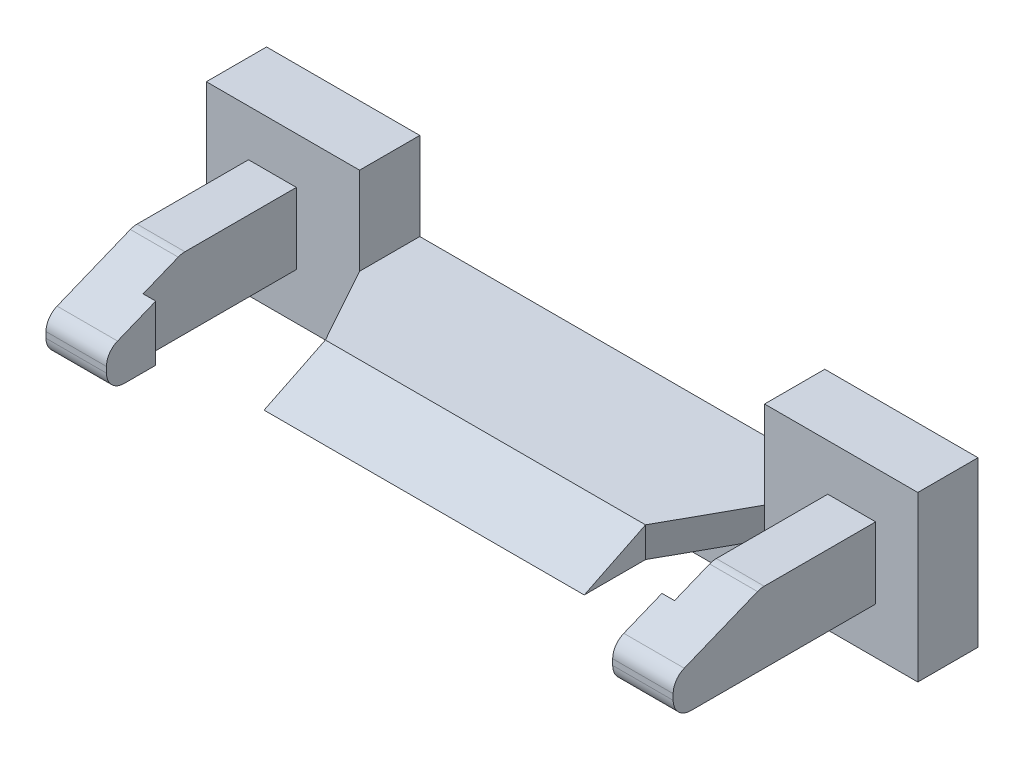
ISO-10303-21;
HEADER;
FILE_DESCRIPTION(('STEP AP214'),'2;1');
FILE_NAME('part.step','',(''),(''),'','','');
FILE_SCHEMA(('AUTOMOTIVE_DESIGN { 1 0 10303 214 1 1 1 1 }'));
ENDSEC;
DATA;
#1=APPLICATION_CONTEXT('core data for automotive mechanical design processes');
#2=APPLICATION_PROTOCOL_DEFINITION('international standard','automotive_design',2000,#1);
#3=PRODUCT_CONTEXT('',#1,'mechanical');
#4=PRODUCT('Part','Part','',(#3));
#5=PRODUCT_RELATED_PRODUCT_CATEGORY('part','',(#4));
#6=PRODUCT_DEFINITION_FORMATION('','',#4);
#7=PRODUCT_DEFINITION_CONTEXT('part definition',#1,'design');
#8=PRODUCT_DEFINITION('design','',#6,#7);
#9=PRODUCT_DEFINITION_SHAPE('','',#8);
#10=(LENGTH_UNIT() NAMED_UNIT(*) SI_UNIT(.MILLI.,.METRE.));
#11=(NAMED_UNIT(*) PLANE_ANGLE_UNIT() SI_UNIT($,.RADIAN.));
#12=(NAMED_UNIT(*) SI_UNIT($,.STERADIAN.) SOLID_ANGLE_UNIT());
#13=UNCERTAINTY_MEASURE_WITH_UNIT(LENGTH_MEASURE(1.E-05),#10,'distance_accuracy_value','');
#14=(GEOMETRIC_REPRESENTATION_CONTEXT(3) GLOBAL_UNCERTAINTY_ASSIGNED_CONTEXT((#13)) GLOBAL_UNIT_ASSIGNED_CONTEXT((#10,
#11,#12)) REPRESENTATION_CONTEXT('',''));
#15=CARTESIAN_POINT('',(0.,0.,0.));
#16=DIRECTION('',(0.,0.,1.));
#17=DIRECTION('',(1.,0.,0.));
#18=AXIS2_PLACEMENT_3D('',#15,#16,#17);
#19=CARTESIAN_POINT('',(4.625,-0.218763919545653,4.475));
#20=DIRECTION('',(1.,0.,0.));
#21=DIRECTION('',(0.,0.,-1.));
#22=AXIS2_PLACEMENT_3D('',#19,#20,#21);
#23=PLANE('',#22);
#24=CARTESIAN_POINT('',(4.625,-0.325000000000004,4.475));
#25=DIRECTION('',(-1.,0.,0.));
#26=DIRECTION('',(0.,-1.,0.));
#27=AXIS2_PLACEMENT_3D('',#24,#25,#26);
#28=CIRCLE('',#27,0.325);
#29=CARTESIAN_POINT('',(4.625,-0.325000000000004,4.8));
#30=VERTEX_POINT('',#29);
#31=CARTESIAN_POINT('',(4.625,-0.65,4.475));
#32=VERTEX_POINT('',#31);
#33=EDGE_CURVE('E231',#30,#32,#28,.F.);
#34=ORIENTED_EDGE('',*,*,#33,.F.);
#35=DIRECTION('',(0.,1.,0.));
#36=VECTOR('',#35,1.);
#37=CARTESIAN_POINT('',(4.625,-0.65,4.8));
#38=LINE('',#37,#36);
#39=CARTESIAN_POINT('',(4.625,-0.218763919545653,4.8));
#40=VERTEX_POINT('',#39);
#41=EDGE_CURVE('E227',#30,#40,#38,.T.);
#42=ORIENTED_EDGE('',*,*,#41,.T.);
#43=CARTESIAN_POINT('',(4.625,-0.218763919545653,4.475));
#44=DIRECTION('',(1.,0.,0.));
#45=DIRECTION('',(0.,0.,-1.));
#46=AXIS2_PLACEMENT_3D('',#43,#44,#45);
#47=CIRCLE('',#46,0.325);
#48=CARTESIAN_POINT('',(4.625,0.0823377180190975,4.59732254026068));
#49=VERTEX_POINT('',#48);
#50=EDGE_CURVE('E19',#49,#40,#47,.T.);
#51=ORIENTED_EDGE('',*,*,#50,.F.);
#52=DIRECTION('',(0.,-0.376377046955938,0.926466577122309));
#53=VECTOR('',#52,1.);
#54=CARTESIAN_POINT('',(4.625,0.,4.8));
#55=LINE('',#54,#53);
#56=CARTESIAN_POINT('',(4.625,0.365624999999999,3.9));
#57=VERTEX_POINT('',#56);
#58=EDGE_CURVE('E222',#57,#49,#55,.T.);
#59=ORIENTED_EDGE('',*,*,#58,.F.);
#60=DIRECTION('',(0.,1.,0.));
#61=VECTOR('',#60,1.);
#62=CARTESIAN_POINT('',(4.625,-0.65,3.9));
#63=LINE('',#62,#61);
#64=CARTESIAN_POINT('',(4.625,-0.65,3.9));
#65=VERTEX_POINT('',#64);
#66=EDGE_CURVE('E261',#65,#57,#63,.T.);
#67=ORIENTED_EDGE('',*,*,#66,.F.);
#68=DIRECTION('',(0.,0.,1.));
#69=VECTOR('',#68,1.);
#70=CARTESIAN_POINT('',(4.625,-0.65,4.8));
#71=LINE('',#70,#69);
#72=EDGE_CURVE('E275',#32,#65,#71,.F.);
#73=ORIENTED_EDGE('',*,*,#72,.F.);
#74=EDGE_LOOP('',(#34,#42,#51,#59,#67,#73));
#75=FACE_BOUND('',#74,.T.);
#76=ADVANCED_FACE('F16',(#75),#23,.F.);
#77=CARTESIAN_POINT('',(4.625,-0.65,3.9));
#78=DIRECTION('',(0.,0.,-1.));
#79=DIRECTION('',(-1.,0.,0.));
#80=AXIS2_PLACEMENT_3D('',#77,#78,#79);
#81=PLANE('',#80);
#82=ORIENTED_EDGE('',*,*,#66,.T.);
#83=DIRECTION('',(1.,0.,0.));
#84=VECTOR('',#83,1.);
#85=CARTESIAN_POINT('',(14.1788797160821,0.365624999999999,3.9));
#86=LINE('',#85,#84);
#87=CARTESIAN_POINT('',(4.855,0.365625,3.9));
#88=VERTEX_POINT('',#87);
#89=EDGE_CURVE('E259',#88,#57,#86,.F.);
#90=ORIENTED_EDGE('',*,*,#89,.F.);
#91=DIRECTION('',(0.,1.,0.));
#92=VECTOR('',#91,1.);
#93=CARTESIAN_POINT('',(4.855,-0.65,3.9));
#94=LINE('',#93,#92);
#95=CARTESIAN_POINT('',(4.855,-0.65,3.9));
#96=VERTEX_POINT('',#95);
#97=EDGE_CURVE('E264',#96,#88,#94,.T.);
#98=ORIENTED_EDGE('',*,*,#97,.F.);
#99=DIRECTION('',(1.,0.,0.));
#100=VECTOR('',#99,1.);
#101=CARTESIAN_POINT('',(5.73,-0.65,3.9));
#102=LINE('',#101,#100);
#103=EDGE_CURVE('E271',#65,#96,#102,.T.);
#104=ORIENTED_EDGE('',*,*,#103,.F.);
#105=EDGE_LOOP('',(#82,#90,#98,#104));
#106=FACE_BOUND('',#105,.T.);
#107=ADVANCED_FACE('F937',(#106),#81,.T.);
#108=CARTESIAN_POINT('',(14.1788797160821,0.,4.8));
#109=DIRECTION('',(0.,0.926466577122309,0.376377046955938));
#110=DIRECTION('',(0.,-0.376377046955938,0.926466577122309));
#111=AXIS2_PLACEMENT_3D('',#108,#109,#110);
#112=PLANE('',#111);
#113=DIRECTION('',(0.,-0.376377046955938,0.926466577122309));
#114=VECTOR('',#113,1.);
#115=CARTESIAN_POINT('',(5.73,0.626101637564755,3.25882673830214));
#116=LINE('',#115,#114);
#117=CARTESIAN_POINT('',(5.73,0.626101637564755,3.25882673830214));
#118=VERTEX_POINT('',#117);
#119=CARTESIAN_POINT('',(5.73,0.0823377180190975,4.59732254026068));
#120=VERTEX_POINT('',#119);
#121=EDGE_CURVE('E318',#118,#120,#116,.T.);
#122=ORIENTED_EDGE('',*,*,#121,.F.);
#123=DIRECTION('',(1.,0.,0.));
#124=VECTOR('',#123,1.);
#125=CARTESIAN_POINT('',(14.1788797160821,0.626101637564759,3.25882673830213));
#126=LINE('',#125,#124);
#127=CARTESIAN_POINT('',(4.855,0.626101637564754,3.25882673830214));
#128=VERTEX_POINT('',#127);
#129=EDGE_CURVE('E321',#128,#118,#126,.T.);
#130=ORIENTED_EDGE('',*,*,#129,.F.);
#131=DIRECTION('',(0.,0.376377046955936,-0.92646657712231));
#132=VECTOR('',#131,1.);
#133=CARTESIAN_POINT('',(4.855,0.365625,3.9));
#134=LINE('',#133,#132);
#135=EDGE_CURVE('E267',#88,#128,#134,.T.);
#136=ORIENTED_EDGE('',*,*,#135,.F.);
#137=ORIENTED_EDGE('',*,*,#89,.T.);
#138=ORIENTED_EDGE('',*,*,#58,.T.);
#139=DIRECTION('',(1.,0.,0.));
#140=VECTOR('',#139,1.);
#141=CARTESIAN_POINT('',(14.1788797160821,0.0823377180190974,4.59732254026068));
#142=LINE('',#141,#140);
#143=EDGE_CURVE('E241',#120,#49,#142,.F.);
#144=ORIENTED_EDGE('',*,*,#143,.F.);
#145=EDGE_LOOP('',(#122,#130,#136,#137,#138,#144));
#146=FACE_BOUND('',#145,.T.);
#147=ADVANCED_FACE('F929',(#146),#112,.T.);
#148=CARTESIAN_POINT('',(14.1788797160821,-0.218763919545653,4.475));
#149=DIRECTION('',(1.,0.,0.));
#150=DIRECTION('',(0.,0.,-1.));
#151=AXIS2_PLACEMENT_3D('',#148,#149,#150);
#152=CYLINDRICAL_SURFACE('',#151,0.325);
#153=DIRECTION('',(-1.,0.,0.));
#154=VECTOR('',#153,1.);
#155=CARTESIAN_POINT('',(5.73,-0.218763919545653,4.8));
#156=LINE('',#155,#154);
#157=CARTESIAN_POINT('',(5.73,-0.218763919545653,4.8));
#158=VERTEX_POINT('',#157);
#159=EDGE_CURVE('E235',#40,#158,#156,.F.);
#160=ORIENTED_EDGE('',*,*,#159,.T.);
#161=CARTESIAN_POINT('',(5.73,-0.218763919545653,4.475));
#162=DIRECTION('',(1.,0.,0.));
#163=DIRECTION('',(0.,0.,-1.));
#164=AXIS2_PLACEMENT_3D('',#161,#162,#163);
#165=CIRCLE('',#164,0.325);
#166=EDGE_CURVE('E316',#120,#158,#165,.T.);
#167=ORIENTED_EDGE('',*,*,#166,.F.);
#168=ORIENTED_EDGE('',*,*,#143,.T.);
#169=ORIENTED_EDGE('',*,*,#50,.T.);
#170=EDGE_LOOP('',(#160,#167,#168,#169));
#171=FACE_BOUND('',#170,.T.);
#172=ADVANCED_FACE('F238',(#171),#152,.T.);
#173=CARTESIAN_POINT('',(5.73,-0.65,4.8));
#174=DIRECTION('',(0.,0.,-1.));
#175=DIRECTION('',(-1.,0.,0.));
#176=AXIS2_PLACEMENT_3D('',#173,#174,#175);
#177=PLANE('',#176);
#178=ORIENTED_EDGE('',*,*,#159,.F.);
#179=ORIENTED_EDGE('',*,*,#41,.F.);
#180=DIRECTION('',(-1.,0.,0.));
#181=VECTOR('',#180,1.);
#182=CARTESIAN_POINT('',(5.73,-0.325000000000004,4.8));
#183=LINE('',#182,#181);
#184=CARTESIAN_POINT('',(5.73,-0.325000000000004,4.8));
#185=VERTEX_POINT('',#184);
#186=EDGE_CURVE('E246',#185,#30,#183,.T.);
#187=ORIENTED_EDGE('',*,*,#186,.F.);
#188=DIRECTION('',(0.,1.,0.));
#189=VECTOR('',#188,1.);
#190=CARTESIAN_POINT('',(5.73,0.65,4.8));
#191=LINE('',#190,#189);
#192=EDGE_CURVE('E244',#158,#185,#191,.F.);
#193=ORIENTED_EDGE('',*,*,#192,.F.);
#194=EDGE_LOOP('',(#178,#179,#187,#193));
#195=FACE_BOUND('',#194,.T.);
#196=ADVANCED_FACE('F242',(#195),#177,.F.);
#197=CARTESIAN_POINT('',(5.73,-0.325000000000004,4.475));
#198=DIRECTION('',(-1.,0.,0.));
#199=DIRECTION('',(0.,-1.,0.));
#200=AXIS2_PLACEMENT_3D('',#197,#198,#199);
#201=CYLINDRICAL_SURFACE('',#200,0.325);
#202=ORIENTED_EDGE('',*,*,#33,.T.);
#203=DIRECTION('',(1.,0.,0.));
#204=VECTOR('',#203,1.);
#205=CARTESIAN_POINT('',(5.73,-0.65,4.475));
#206=LINE('',#205,#204);
#207=CARTESIAN_POINT('',(5.73,-0.65,4.475));
#208=VERTEX_POINT('',#207);
#209=EDGE_CURVE('E283',#208,#32,#206,.F.);
#210=ORIENTED_EDGE('',*,*,#209,.F.);
#211=CARTESIAN_POINT('',(5.73,-0.325000000000004,4.475));
#212=DIRECTION('',(-1.,0.,0.));
#213=DIRECTION('',(0.,-1.,0.));
#214=AXIS2_PLACEMENT_3D('',#211,#212,#213);
#215=CIRCLE('',#214,0.325);
#216=EDGE_CURVE('E312',#185,#208,#215,.F.);
#217=ORIENTED_EDGE('',*,*,#216,.F.);
#218=ORIENTED_EDGE('',*,*,#186,.T.);
#219=EDGE_LOOP('',(#202,#210,#217,#218));
#220=FACE_BOUND('',#219,.T.);
#221=ADVANCED_FACE('F907',(#220),#201,.T.);
#222=CARTESIAN_POINT('',(5.73,-0.65,4.8));
#223=DIRECTION('',(0.,-1.,0.));
#224=DIRECTION('',(1.,0.,0.));
#225=AXIS2_PLACEMENT_3D('',#222,#223,#224);
#226=PLANE('',#225);
#227=DIRECTION('',(0.,0.,1.));
#228=VECTOR('',#227,1.);
#229=CARTESIAN_POINT('',(4.855,-0.65,4.8));
#230=LINE('',#229,#228);
#231=CARTESIAN_POINT('',(4.855,-0.65,1.1));
#232=VERTEX_POINT('',#231);
#233=EDGE_CURVE('E252',#232,#96,#230,.T.);
#234=ORIENTED_EDGE('',*,*,#233,.F.);
#235=DIRECTION('',(1.,0.,0.));
#236=VECTOR('',#235,1.);
#237=CARTESIAN_POINT('',(5.73,-0.65,1.1));
#238=LINE('',#237,#236);
#239=CARTESIAN_POINT('',(5.73,-0.65,1.1));
#240=VERTEX_POINT('',#239);
#241=EDGE_CURVE('E274',#232,#240,#238,.T.);
#242=ORIENTED_EDGE('',*,*,#241,.T.);
#243=DIRECTION('',(0.,0.,-1.));
#244=VECTOR('',#243,1.);
#245=CARTESIAN_POINT('',(5.73,-0.65,4.8));
#246=LINE('',#245,#244);
#247=EDGE_CURVE('E315',#208,#240,#246,.T.);
#248=ORIENTED_EDGE('',*,*,#247,.F.);
#249=ORIENTED_EDGE('',*,*,#209,.T.);
#250=ORIENTED_EDGE('',*,*,#72,.T.);
#251=ORIENTED_EDGE('',*,*,#103,.T.);
#252=EDGE_LOOP('',(#234,#242,#248,#249,#250,#251));
#253=FACE_BOUND('',#252,.T.);
#254=ADVANCED_FACE('F335',(#253),#226,.T.);
#255=CARTESIAN_POINT('',(-4.855,-0.65,4.8));
#256=DIRECTION('',(-1.,0.,0.));
#257=DIRECTION('',(0.,0.,1.));
#258=AXIS2_PLACEMENT_3D('',#255,#256,#257);
#259=PLANE('',#258);
#260=DIRECTION('',(0.,1.,0.));
#261=VECTOR('',#260,1.);
#262=CARTESIAN_POINT('',(-4.855,0.365625,3.9));
#263=LINE('',#262,#261);
#264=CARTESIAN_POINT('',(-4.855,-0.65,3.9));
#265=VERTEX_POINT('',#264);
#266=CARTESIAN_POINT('',(-4.855,0.365624999999999,3.9));
#267=VERTEX_POINT('',#266);
#268=EDGE_CURVE('E395',#265,#267,#263,.T.);
#269=ORIENTED_EDGE('',*,*,#268,.F.);
#270=DIRECTION('',(0.,0.,1.));
#271=VECTOR('',#270,1.);
#272=CARTESIAN_POINT('',(-4.855,-0.65,4.8));
#273=LINE('',#272,#271);
#274=CARTESIAN_POINT('',(-4.855,-0.65,1.1));
#275=VERTEX_POINT('',#274);
#276=EDGE_CURVE('E429',#265,#275,#273,.F.);
#277=ORIENTED_EDGE('',*,*,#276,.T.);
#278=DIRECTION('',(0.,1.,0.));
#279=VECTOR('',#278,1.);
#280=CARTESIAN_POINT('',(-4.855,-0.65,1.1));
#281=LINE('',#280,#279);
#282=CARTESIAN_POINT('',(-4.855,0.65,1.1));
#283=VERTEX_POINT('',#282);
#284=EDGE_CURVE('E323',#283,#275,#281,.F.);
#285=ORIENTED_EDGE('',*,*,#284,.F.);
#286=DIRECTION('',(0.,0.,1.));
#287=VECTOR('',#286,1.);
#288=CARTESIAN_POINT('',(-4.855,0.65,4.8));
#289=LINE('',#288,#287);
#290=CARTESIAN_POINT('',(-4.855,0.65,3.13650419804148));
#291=VERTEX_POINT('',#290);
#292=EDGE_CURVE('E407',#283,#291,#289,.T.);
#293=ORIENTED_EDGE('',*,*,#292,.T.);
#294=CARTESIAN_POINT('',(-4.855,0.325,3.13650419804148));
#295=DIRECTION('',(-1.,0.,0.));
#296=DIRECTION('',(0.,0.,1.));
#297=AXIS2_PLACEMENT_3D('',#294,#295,#296);
#298=CIRCLE('',#297,0.325);
#299=CARTESIAN_POINT('',(-4.855,0.626101637564748,3.25882673830216));
#300=VERTEX_POINT('',#299);
#301=EDGE_CURVE('E322',#300,#291,#298,.T.);
#302=ORIENTED_EDGE('',*,*,#301,.F.);
#303=DIRECTION('',(0.,0.376377046955939,-0.926466577122309));
#304=VECTOR('',#303,1.);
#305=CARTESIAN_POINT('',(-4.855,0.365625,3.9));
#306=LINE('',#305,#304);
#307=EDGE_CURVE('E404',#267,#300,#306,.T.);
#308=ORIENTED_EDGE('',*,*,#307,.F.);
#309=EDGE_LOOP('',(#269,#277,#285,#293,#302,#308));
#310=FACE_BOUND('',#309,.T.);
#311=ADVANCED_FACE('F493',(#310),#259,.F.);
#312=CARTESIAN_POINT('',(-4.625,0.365625,3.9));
#313=DIRECTION('',(0.,0.,-1.));
#314=DIRECTION('',(-1.,0.,0.));
#315=AXIS2_PLACEMENT_3D('',#312,#313,#314);
#316=PLANE('',#315);
#317=DIRECTION('',(0.,1.,0.));
#318=VECTOR('',#317,1.);
#319=CARTESIAN_POINT('',(-4.625,-0.325,3.9));
#320=LINE('',#319,#318);
#321=CARTESIAN_POINT('',(-4.625,0.365624999999999,3.9));
#322=VERTEX_POINT('',#321);
#323=CARTESIAN_POINT('',(-4.625,-0.65,3.9));
#324=VERTEX_POINT('',#323);
#325=EDGE_CURVE('E268',#322,#324,#320,.F.);
#326=ORIENTED_EDGE('',*,*,#325,.T.);
#327=DIRECTION('',(-1.,0.,0.));
#328=VECTOR('',#327,1.);
#329=CARTESIAN_POINT('',(-5.73,-0.65,3.9));
#330=LINE('',#329,#328);
#331=EDGE_CURVE('E423',#324,#265,#330,.T.);
#332=ORIENTED_EDGE('',*,*,#331,.T.);
#333=ORIENTED_EDGE('',*,*,#268,.T.);
#334=DIRECTION('',(1.,0.,0.));
#335=VECTOR('',#334,1.);
#336=CARTESIAN_POINT('',(-14.1788797160821,0.365624999999999,3.9));
#337=LINE('',#336,#335);
#338=EDGE_CURVE('E391',#267,#322,#337,.T.);
#339=ORIENTED_EDGE('',*,*,#338,.T.);
#340=EDGE_LOOP('',(#326,#332,#333,#339));
#341=FACE_BOUND('',#340,.T.);
#342=ADVANCED_FACE('F497',(#341),#316,.T.);
#343=CARTESIAN_POINT('',(-4.625,-0.325,4.475));
#344=DIRECTION('',(-1.,0.,0.));
#345=DIRECTION('',(0.,0.,1.));
#346=AXIS2_PLACEMENT_3D('',#343,#344,#345);
#347=PLANE('',#346);
#348=DIRECTION('',(0.,0.376377046955938,-0.926466577122309));
#349=VECTOR('',#348,1.);
#350=CARTESIAN_POINT('',(-4.625,0.,4.8));
#351=LINE('',#350,#349);
#352=CARTESIAN_POINT('',(-4.625,0.0823377180190975,4.59732254026068));
#353=VERTEX_POINT('',#352);
#354=EDGE_CURVE('E304',#322,#353,#351,.F.);
#355=ORIENTED_EDGE('',*,*,#354,.T.);
#356=CARTESIAN_POINT('',(-4.625,-0.218763919545653,4.475));
#357=DIRECTION('',(1.,0.,0.));
#358=DIRECTION('',(0.,0.,-1.));
#359=AXIS2_PLACEMENT_3D('',#356,#357,#358);
#360=CIRCLE('',#359,0.325);
#361=CARTESIAN_POINT('',(-4.625,-0.218763919545653,4.8));
#362=VERTEX_POINT('',#361);
#363=EDGE_CURVE('E300',#362,#353,#360,.F.);
#364=ORIENTED_EDGE('',*,*,#363,.F.);
#365=DIRECTION('',(0.,1.,0.));
#366=VECTOR('',#365,1.);
#367=CARTESIAN_POINT('',(-4.625,-0.65,4.8));
#368=LINE('',#367,#366);
#369=CARTESIAN_POINT('',(-4.625,-0.325000000000004,4.8));
#370=VERTEX_POINT('',#369);
#371=EDGE_CURVE('E385',#370,#362,#368,.T.);
#372=ORIENTED_EDGE('',*,*,#371,.F.);
#373=CARTESIAN_POINT('',(-4.625,-0.325000000000004,4.475));
#374=DIRECTION('',(1.,0.,0.));
#375=DIRECTION('',(0.,1.,0.));
#376=AXIS2_PLACEMENT_3D('',#373,#374,#375);
#377=CIRCLE('',#376,0.325);
#378=CARTESIAN_POINT('',(-4.625,-0.65,4.475));
#379=VERTEX_POINT('',#378);
#380=EDGE_CURVE('E305',#379,#370,#377,.F.);
#381=ORIENTED_EDGE('',*,*,#380,.F.);
#382=DIRECTION('',(0.,0.,1.));
#383=VECTOR('',#382,1.);
#384=CARTESIAN_POINT('',(-4.625,-0.65,4.8));
#385=LINE('',#384,#383);
#386=EDGE_CURVE('E420',#379,#324,#385,.F.);
#387=ORIENTED_EDGE('',*,*,#386,.T.);
#388=ORIENTED_EDGE('',*,*,#325,.F.);
#389=EDGE_LOOP('',(#355,#364,#372,#381,#387,#388));
#390=FACE_BOUND('',#389,.T.);
#391=ADVANCED_FACE('F503',(#390),#347,.F.);
#392=CARTESIAN_POINT('',(4.855,-0.65,4.8));
#393=DIRECTION('',(-1.,0.,0.));
#394=DIRECTION('',(0.,0.,1.));
#395=AXIS2_PLACEMENT_3D('',#392,#393,#394);
#396=PLANE('',#395);
#397=DIRECTION('',(0.,1.,0.));
#398=VECTOR('',#397,1.);
#399=CARTESIAN_POINT('',(4.855,-0.65,1.1));
#400=LINE('',#399,#398);
#401=CARTESIAN_POINT('',(4.855,0.65,1.1));
#402=VERTEX_POINT('',#401);
#403=EDGE_CURVE('E256',#402,#232,#400,.F.);
#404=ORIENTED_EDGE('',*,*,#403,.T.);
#405=ORIENTED_EDGE('',*,*,#233,.T.);
#406=ORIENTED_EDGE('',*,*,#97,.T.);
#407=ORIENTED_EDGE('',*,*,#135,.T.);
#408=CARTESIAN_POINT('',(4.855,0.325000000000004,3.13650419804147));
#409=DIRECTION('',(1.,0.,0.));
#410=DIRECTION('',(0.,0.,-1.));
#411=AXIS2_PLACEMENT_3D('',#408,#409,#410);
#412=CIRCLE('',#411,0.325);
#413=CARTESIAN_POINT('',(4.855,0.65,3.13650419804146));
#414=VERTEX_POINT('',#413);
#415=EDGE_CURVE('E255',#414,#128,#412,.T.);
#416=ORIENTED_EDGE('',*,*,#415,.F.);
#417=DIRECTION('',(0.,0.,1.));
#418=VECTOR('',#417,1.);
#419=CARTESIAN_POINT('',(4.855,0.65,4.8));
#420=LINE('',#419,#418);
#421=EDGE_CURVE('E363',#402,#414,#420,.T.);
#422=ORIENTED_EDGE('',*,*,#421,.F.);
#423=EDGE_LOOP('',(#404,#405,#406,#407,#416,#422));
#424=FACE_BOUND('',#423,.T.);
#425=ADVANCED_FACE('F869',(#424),#396,.T.);
#426=CARTESIAN_POINT('',(14.1788797160821,0.325000000000006,3.13650419804146));
#427=DIRECTION('',(1.,0.,0.));
#428=DIRECTION('',(0.,0.,-1.));
#429=AXIS2_PLACEMENT_3D('',#426,#427,#428);
#430=CYLINDRICAL_SURFACE('',#429,0.325);
#431=ORIENTED_EDGE('',*,*,#415,.T.);
#432=ORIENTED_EDGE('',*,*,#129,.T.);
#433=CARTESIAN_POINT('',(5.73,0.325000000000004,3.13650419804147));
#434=DIRECTION('',(1.,0.,0.));
#435=DIRECTION('',(0.,0.,-1.));
#436=AXIS2_PLACEMENT_3D('',#433,#434,#435);
#437=CIRCLE('',#436,0.325);
#438=CARTESIAN_POINT('',(5.73,0.65,3.13650419804146));
#439=VERTEX_POINT('',#438);
#440=EDGE_CURVE('E308',#439,#118,#437,.T.);
#441=ORIENTED_EDGE('',*,*,#440,.F.);
#442=DIRECTION('',(-1.,0.,0.));
#443=VECTOR('',#442,1.);
#444=CARTESIAN_POINT('',(4.855,0.65,3.13650419804146));
#445=LINE('',#444,#443);
#446=EDGE_CURVE('E360',#414,#439,#445,.F.);
#447=ORIENTED_EDGE('',*,*,#446,.F.);
#448=EDGE_LOOP('',(#431,#432,#441,#447));
#449=FACE_BOUND('',#448,.T.);
#450=ADVANCED_FACE('F861',(#449),#430,.T.);
#451=CARTESIAN_POINT('',(5.73,0.65,4.8));
#452=DIRECTION('',(1.,0.,0.));
#453=DIRECTION('',(0.,0.,-1.));
#454=AXIS2_PLACEMENT_3D('',#451,#452,#453);
#455=PLANE('',#454);
#456=DIRECTION('',(0.,0.,1.));
#457=VECTOR('',#456,1.);
#458=CARTESIAN_POINT('',(5.73,0.65,4.8));
#459=LINE('',#458,#457);
#460=CARTESIAN_POINT('',(5.73,0.65,1.1));
#461=VERTEX_POINT('',#460);
#462=EDGE_CURVE('E299',#439,#461,#459,.F.);
#463=ORIENTED_EDGE('',*,*,#462,.F.);
#464=ORIENTED_EDGE('',*,*,#440,.T.);
#465=ORIENTED_EDGE('',*,*,#121,.T.);
#466=ORIENTED_EDGE('',*,*,#166,.T.);
#467=ORIENTED_EDGE('',*,*,#192,.T.);
#468=ORIENTED_EDGE('',*,*,#216,.T.);
#469=ORIENTED_EDGE('',*,*,#247,.T.);
#470=DIRECTION('',(0.,1.,0.));
#471=VECTOR('',#470,1.);
#472=CARTESIAN_POINT('',(5.73,0.65,1.1));
#473=LINE('',#472,#471);
#474=EDGE_CURVE('E311',#240,#461,#473,.T.);
#475=ORIENTED_EDGE('',*,*,#474,.T.);
#476=EDGE_LOOP('',(#463,#464,#465,#466,#467,#468,#469,#475));
#477=FACE_BOUND('',#476,.T.);
#478=ADVANCED_FACE('F348',(#477),#455,.T.);
#479=CARTESIAN_POINT('',(-5.73,-0.325000000000004,4.475));
#480=DIRECTION('',(1.,0.,0.));
#481=DIRECTION('',(0.,1.,0.));
#482=AXIS2_PLACEMENT_3D('',#479,#480,#481);
#483=CYLINDRICAL_SURFACE('',#482,0.325);
#484=ORIENTED_EDGE('',*,*,#380,.T.);
#485=DIRECTION('',(1.,0.,0.));
#486=VECTOR('',#485,1.);
#487=CARTESIAN_POINT('',(-5.73,-0.325000000000004,4.8));
#488=LINE('',#487,#486);
#489=CARTESIAN_POINT('',(-5.73,-0.325000000000004,4.8));
#490=VERTEX_POINT('',#489);
#491=EDGE_CURVE('E389',#490,#370,#488,.T.);
#492=ORIENTED_EDGE('',*,*,#491,.F.);
#493=CARTESIAN_POINT('',(-5.73,-0.325000000000004,4.475));
#494=DIRECTION('',(1.,0.,0.));
#495=DIRECTION('',(0.,1.,0.));
#496=AXIS2_PLACEMENT_3D('',#493,#494,#495);
#497=CIRCLE('',#496,0.325);
#498=CARTESIAN_POINT('',(-5.73,-0.65,4.475));
#499=VERTEX_POINT('',#498);
#500=EDGE_CURVE('E296',#490,#499,#497,.T.);
#501=ORIENTED_EDGE('',*,*,#500,.T.);
#502=DIRECTION('',(-1.,0.,0.));
#503=VECTOR('',#502,1.);
#504=CARTESIAN_POINT('',(-5.73,-0.65,4.475));
#505=LINE('',#504,#503);
#506=EDGE_CURVE('E424',#499,#379,#505,.F.);
#507=ORIENTED_EDGE('',*,*,#506,.T.);
#508=EDGE_LOOP('',(#484,#492,#501,#507));
#509=FACE_BOUND('',#508,.T.);
#510=ADVANCED_FACE('F507',(#509),#483,.T.);
#511=CARTESIAN_POINT('',(-5.73,-0.65,4.8));
#512=DIRECTION('',(0.,1.,0.));
#513=DIRECTION('',(-1.,0.,0.));
#514=AXIS2_PLACEMENT_3D('',#511,#512,#513);
#515=PLANE('',#514);
#516=ORIENTED_EDGE('',*,*,#331,.F.);
#517=ORIENTED_EDGE('',*,*,#386,.F.);
#518=ORIENTED_EDGE('',*,*,#506,.F.);
#519=DIRECTION('',(0.,0.,-1.));
#520=VECTOR('',#519,1.);
#521=CARTESIAN_POINT('',(-5.73,-0.65,4.8));
#522=LINE('',#521,#520);
#523=CARTESIAN_POINT('',(-5.73,-0.65,1.1));
#524=VERTEX_POINT('',#523);
#525=EDGE_CURVE('E298',#499,#524,#522,.T.);
#526=ORIENTED_EDGE('',*,*,#525,.T.);
#527=DIRECTION('',(-1.,0.,0.));
#528=VECTOR('',#527,1.);
#529=CARTESIAN_POINT('',(-5.73,-0.65,1.1));
#530=LINE('',#529,#528);
#531=EDGE_CURVE('E307',#275,#524,#530,.T.);
#532=ORIENTED_EDGE('',*,*,#531,.F.);
#533=ORIENTED_EDGE('',*,*,#276,.F.);
#534=EDGE_LOOP('',(#516,#517,#518,#526,#532,#533));
#535=FACE_BOUND('',#534,.T.);
#536=ADVANCED_FACE('F457',(#535),#515,.F.);
#537=CARTESIAN_POINT('',(-4.855,0.65,4.8));
#538=DIRECTION('',(0.,-1.,0.));
#539=DIRECTION('',(1.,0.,0.));
#540=AXIS2_PLACEMENT_3D('',#537,#538,#539);
#541=PLANE('',#540);
#542=DIRECTION('',(-1.,0.,0.));
#543=VECTOR('',#542,1.);
#544=CARTESIAN_POINT('',(-4.855,0.65,3.13650419804148));
#545=LINE('',#544,#543);
#546=CARTESIAN_POINT('',(-5.73,0.65,3.13650419804148));
#547=VERTEX_POINT('',#546);
#548=EDGE_CURVE('E410',#291,#547,#545,.T.);
#549=ORIENTED_EDGE('',*,*,#548,.F.);
#550=ORIENTED_EDGE('',*,*,#292,.F.);
#551=DIRECTION('',(1.,0.,0.));
#552=VECTOR('',#551,1.);
#553=CARTESIAN_POINT('',(-4.855,0.65,1.1));
#554=LINE('',#553,#552);
#555=CARTESIAN_POINT('',(-5.73,0.65,1.1));
#556=VERTEX_POINT('',#555);
#557=EDGE_CURVE('E411',#556,#283,#554,.T.);
#558=ORIENTED_EDGE('',*,*,#557,.F.);
#559=DIRECTION('',(0.,0.,-1.));
#560=VECTOR('',#559,1.);
#561=CARTESIAN_POINT('',(-5.73,0.65,4.8));
#562=LINE('',#561,#560);
#563=EDGE_CURVE('E295',#556,#547,#562,.F.);
#564=ORIENTED_EDGE('',*,*,#563,.T.);
#565=EDGE_LOOP('',(#549,#550,#558,#564));
#566=FACE_BOUND('',#565,.T.);
#567=ADVANCED_FACE('F492',(#566),#541,.F.);
#568=CARTESIAN_POINT('',(-4.855,0.325,3.13650419804148));
#569=DIRECTION('',(-1.,0.,0.));
#570=DIRECTION('',(0.,0.,1.));
#571=AXIS2_PLACEMENT_3D('',#568,#569,#570);
#572=CYLINDRICAL_SURFACE('',#571,0.325);
#573=ORIENTED_EDGE('',*,*,#301,.T.);
#574=ORIENTED_EDGE('',*,*,#548,.T.);
#575=CARTESIAN_POINT('',(-5.73,0.325,3.13650419804148));
#576=DIRECTION('',(-1.,0.,0.));
#577=DIRECTION('',(0.,0.,1.));
#578=AXIS2_PLACEMENT_3D('',#575,#576,#577);
#579=CIRCLE('',#578,0.325);
#580=CARTESIAN_POINT('',(-5.73,0.626101637564747,3.25882673830216));
#581=VERTEX_POINT('',#580);
#582=EDGE_CURVE('E293',#547,#581,#579,.F.);
#583=ORIENTED_EDGE('',*,*,#582,.T.);
#584=DIRECTION('',(1.,0.,0.));
#585=VECTOR('',#584,1.);
#586=CARTESIAN_POINT('',(-14.1788797160821,0.626101637564746,3.25882673830216));
#587=LINE('',#586,#585);
#588=EDGE_CURVE('E399',#581,#300,#587,.T.);
#589=ORIENTED_EDGE('',*,*,#588,.T.);
#590=EDGE_LOOP('',(#573,#574,#583,#589));
#591=FACE_BOUND('',#590,.T.);
#592=ADVANCED_FACE('F490',(#591),#572,.T.);
#593=CARTESIAN_POINT('',(-14.1788797160821,0.,4.8));
#594=DIRECTION('',(0.,-0.926466577122309,-0.376377046955938));
#595=DIRECTION('',(0.,0.376377046955938,-0.926466577122309));
#596=AXIS2_PLACEMENT_3D('',#593,#594,#595);
#597=PLANE('',#596);
#598=DIRECTION('',(1.,0.,0.));
#599=VECTOR('',#598,1.);
#600=CARTESIAN_POINT('',(-14.1788797160821,0.0823377180190974,4.59732254026068));
#601=LINE('',#600,#599);
#602=CARTESIAN_POINT('',(-5.73,0.0823377180190974,4.59732254026068));
#603=VERTEX_POINT('',#602);
#604=EDGE_CURVE('E303',#353,#603,#601,.F.);
#605=ORIENTED_EDGE('',*,*,#604,.F.);
#606=ORIENTED_EDGE('',*,*,#354,.F.);
#607=ORIENTED_EDGE('',*,*,#338,.F.);
#608=ORIENTED_EDGE('',*,*,#307,.T.);
#609=ORIENTED_EDGE('',*,*,#588,.F.);
#610=DIRECTION('',(0.,-0.376377046955939,0.926466577122309));
#611=VECTOR('',#610,1.);
#612=CARTESIAN_POINT('',(-5.73,0.626101637564748,3.25882673830216));
#613=LINE('',#612,#611);
#614=EDGE_CURVE('E292',#581,#603,#613,.T.);
#615=ORIENTED_EDGE('',*,*,#614,.T.);
#616=EDGE_LOOP('',(#605,#606,#607,#608,#609,#615));
#617=FACE_BOUND('',#616,.T.);
#618=ADVANCED_FACE('F501',(#617),#597,.F.);
#619=CARTESIAN_POINT('',(-14.1788797160821,-0.218763919545653,4.475));
#620=DIRECTION('',(1.,0.,0.));
#621=DIRECTION('',(0.,0.,-1.));
#622=AXIS2_PLACEMENT_3D('',#619,#620,#621);
#623=CYLINDRICAL_SURFACE('',#622,0.325);
#624=ORIENTED_EDGE('',*,*,#363,.T.);
#625=ORIENTED_EDGE('',*,*,#604,.T.);
#626=CARTESIAN_POINT('',(-5.73,-0.218763919545653,4.475));
#627=DIRECTION('',(1.,0.,0.));
#628=DIRECTION('',(0.,0.,-1.));
#629=AXIS2_PLACEMENT_3D('',#626,#627,#628);
#630=CIRCLE('',#629,0.325);
#631=CARTESIAN_POINT('',(-5.73,-0.218763919545653,4.8));
#632=VERTEX_POINT('',#631);
#633=EDGE_CURVE('E289',#603,#632,#630,.T.);
#634=ORIENTED_EDGE('',*,*,#633,.T.);
#635=DIRECTION('',(1.,0.,0.));
#636=VECTOR('',#635,1.);
#637=CARTESIAN_POINT('',(-5.73,-0.218763919545653,4.8));
#638=LINE('',#637,#636);
#639=EDGE_CURVE('E388',#362,#632,#638,.F.);
#640=ORIENTED_EDGE('',*,*,#639,.F.);
#641=EDGE_LOOP('',(#624,#625,#634,#640));
#642=FACE_BOUND('',#641,.T.);
#643=ADVANCED_FACE('F810',(#642),#623,.T.);
#644=CARTESIAN_POINT('',(-5.73,-0.65,4.8));
#645=DIRECTION('',(0.,0.,1.));
#646=DIRECTION('',(1.,0.,0.));
#647=AXIS2_PLACEMENT_3D('',#644,#645,#646);
#648=PLANE('',#647);
#649=ORIENTED_EDGE('',*,*,#639,.T.);
#650=DIRECTION('',(0.,1.,0.));
#651=VECTOR('',#650,1.);
#652=CARTESIAN_POINT('',(-5.73,0.65,4.8));
#653=LINE('',#652,#651);
#654=EDGE_CURVE('E291',#632,#490,#653,.F.);
#655=ORIENTED_EDGE('',*,*,#654,.T.);
#656=ORIENTED_EDGE('',*,*,#491,.T.);
#657=ORIENTED_EDGE('',*,*,#371,.T.);
#658=EDGE_LOOP('',(#649,#655,#656,#657));
#659=FACE_BOUND('',#658,.T.);
#660=ADVANCED_FACE('F802',(#659),#648,.T.);
#661=CARTESIAN_POINT('',(2.925,-13.8240700230838,3.62));
#662=DIRECTION('',(1.,0.,0.));
#663=DIRECTION('',(0.,0.,-1.));
#664=AXIS2_PLACEMENT_3D('',#661,#662,#663);
#665=PLANE('',#664);
#666=DIRECTION('',(0.,1.,0.));
#667=VECTOR('',#666,1.);
#668=CARTESIAN_POINT('',(2.925,-13.8240700230838,2.5));
#669=LINE('',#668,#667);
#670=CARTESIAN_POINT('',(2.925,-0.0999999999999999,2.5));
#671=VERTEX_POINT('',#670);
#672=CARTESIAN_POINT('',(2.925,-0.649999999999998,2.5));
#673=VERTEX_POINT('',#672);
#674=EDGE_CURVE('E511',#671,#673,#669,.F.);
#675=ORIENTED_EDGE('',*,*,#674,.F.);
#676=DIRECTION('',(0.,-0.440790605784194,0.897609960869644));
#677=VECTOR('',#676,1.);
#678=CARTESIAN_POINT('',(2.925,-0.65,3.62));
#679=LINE('',#678,#677);
#680=CARTESIAN_POINT('',(2.925,-0.649999999999999,3.62));
#681=VERTEX_POINT('',#680);
#682=EDGE_CURVE('E524',#681,#671,#679,.F.);
#683=ORIENTED_EDGE('',*,*,#682,.F.);
#684=DIRECTION('',(0.,0.,1.));
#685=VECTOR('',#684,1.);
#686=CARTESIAN_POINT('',(2.925,-0.649999999999998,3.62));
#687=LINE('',#686,#685);
#688=EDGE_CURVE('E479',#681,#673,#687,.F.);
#689=ORIENTED_EDGE('',*,*,#688,.T.);
#690=EDGE_LOOP('',(#675,#683,#689));
#691=FACE_BOUND('',#690,.T.);
#692=ADVANCED_FACE('F652',(#691),#665,.T.);
#693=CARTESIAN_POINT('',(-2.925,-13.8240700230838,3.62));
#694=DIRECTION('',(1.,0.,0.));
#695=DIRECTION('',(0.,0.,-1.));
#696=AXIS2_PLACEMENT_3D('',#693,#694,#695);
#697=PLANE('',#696);
#698=DIRECTION('',(0.,1.,0.));
#699=VECTOR('',#698,1.);
#700=CARTESIAN_POINT('',(-2.925,-13.8240700230838,2.5));
#701=LINE('',#700,#699);
#702=CARTESIAN_POINT('',(-2.925,-0.1,2.5));
#703=VERTEX_POINT('',#702);
#704=CARTESIAN_POINT('',(-2.925,-0.649999999999998,2.5));
#705=VERTEX_POINT('',#704);
#706=EDGE_CURVE('E527',#703,#705,#701,.F.);
#707=ORIENTED_EDGE('',*,*,#706,.T.);
#708=DIRECTION('',(0.,0.,1.));
#709=VECTOR('',#708,1.);
#710=CARTESIAN_POINT('',(-2.925,-0.65,3.62));
#711=LINE('',#710,#709);
#712=CARTESIAN_POINT('',(-2.925,-0.65,3.62));
#713=VERTEX_POINT('',#712);
#714=EDGE_CURVE('E376',#705,#713,#711,.T.);
#715=ORIENTED_EDGE('',*,*,#714,.T.);
#716=DIRECTION('',(0.,-0.440790605784194,0.897609960869644));
#717=VECTOR('',#716,1.);
#718=CARTESIAN_POINT('',(-2.925,-0.65,3.62));
#719=LINE('',#718,#717);
#720=EDGE_CURVE('E518',#703,#713,#719,.T.);
#721=ORIENTED_EDGE('',*,*,#720,.F.);
#722=EDGE_LOOP('',(#707,#715,#721));
#723=FACE_BOUND('',#722,.T.);
#724=ADVANCED_FACE('F643',(#723),#697,.F.);
#725=CARTESIAN_POINT('',(-3.7,-0.65,3.62));
#726=DIRECTION('',(0.,1.,0.));
#727=DIRECTION('',(-1.,0.,0.));
#728=AXIS2_PLACEMENT_3D('',#725,#726,#727);
#729=PLANE('',#728);
#730=ORIENTED_EDGE('',*,*,#714,.F.);
#731=DIRECTION('',(-0.484315883016802,0.,-0.87489320803036));
#732=VECTOR('',#731,1.);
#733=CARTESIAN_POINT('',(-2.925,-0.649999999999993,2.5));
#734=LINE('',#733,#732);
#735=CARTESIAN_POINT('',(-3.7,-0.649999999999995,1.1));
#736=VERTEX_POINT('',#735);
#737=EDGE_CURVE('E529',#705,#736,#734,.T.);
#738=ORIENTED_EDGE('',*,*,#737,.T.);
#739=DIRECTION('',(-1.,0.,0.));
#740=VECTOR('',#739,1.);
#741=CARTESIAN_POINT('',(6.5,-0.65,1.1));
#742=LINE('',#741,#740);
#743=CARTESIAN_POINT('',(3.7,-0.649999999999996,1.1));
#744=VERTEX_POINT('',#743);
#745=EDGE_CURVE('E534',#736,#744,#742,.F.);
#746=ORIENTED_EDGE('',*,*,#745,.T.);
#747=DIRECTION('',(0.484315883016802,0.,-0.87489320803036));
#748=VECTOR('',#747,1.);
#749=CARTESIAN_POINT('',(2.925,-0.649999999999993,2.5));
#750=LINE('',#749,#748);
#751=EDGE_CURVE('E513',#673,#744,#750,.T.);
#752=ORIENTED_EDGE('',*,*,#751,.F.);
#753=ORIENTED_EDGE('',*,*,#688,.F.);
#754=DIRECTION('',(1.,0.,0.));
#755=VECTOR('',#754,1.);
#756=CARTESIAN_POINT('',(13.8240765697478,-0.65,3.62));
#757=LINE('',#756,#755);
#758=EDGE_CURVE('E521',#713,#681,#757,.T.);
#759=ORIENTED_EDGE('',*,*,#758,.F.);
#760=EDGE_LOOP('',(#730,#738,#746,#752,#753,#759));
#761=FACE_BOUND('',#760,.T.);
#762=ADVANCED_FACE('F646',(#761),#729,.F.);
#763=CARTESIAN_POINT('',(4.855,0.65,4.8));
#764=DIRECTION('',(0.,1.,0.));
#765=DIRECTION('',(-1.,0.,0.));
#766=AXIS2_PLACEMENT_3D('',#763,#764,#765);
#767=PLANE('',#766);
#768=ORIENTED_EDGE('',*,*,#462,.T.);
#769=DIRECTION('',(-1.,0.,0.));
#770=VECTOR('',#769,1.);
#771=CARTESIAN_POINT('',(6.5,0.65,1.1));
#772=LINE('',#771,#770);
#773=EDGE_CURVE('E343',#461,#402,#772,.T.);
#774=ORIENTED_EDGE('',*,*,#773,.T.);
#775=ORIENTED_EDGE('',*,*,#421,.T.);
#776=ORIENTED_EDGE('',*,*,#446,.T.);
#777=EDGE_LOOP('',(#768,#774,#775,#776));
#778=FACE_BOUND('',#777,.T.);
#779=ADVANCED_FACE('F662',(#778),#767,.T.);
#780=CARTESIAN_POINT('',(-5.73,0.65,4.8));
#781=DIRECTION('',(1.,0.,0.));
#782=DIRECTION('',(0.,0.,-1.));
#783=AXIS2_PLACEMENT_3D('',#780,#781,#782);
#784=PLANE('',#783);
#785=ORIENTED_EDGE('',*,*,#633,.F.);
#786=ORIENTED_EDGE('',*,*,#614,.F.);
#787=ORIENTED_EDGE('',*,*,#582,.F.);
#788=ORIENTED_EDGE('',*,*,#563,.F.);
#789=DIRECTION('',(0.,1.,0.));
#790=VECTOR('',#789,1.);
#791=CARTESIAN_POINT('',(-5.73,-1.5,1.1));
#792=LINE('',#791,#790);
#793=EDGE_CURVE('E370',#556,#524,#792,.F.);
#794=ORIENTED_EDGE('',*,*,#793,.T.);
#795=ORIENTED_EDGE('',*,*,#525,.F.);
#796=ORIENTED_EDGE('',*,*,#500,.F.);
#797=ORIENTED_EDGE('',*,*,#654,.F.);
#798=EDGE_LOOP('',(#785,#786,#787,#788,#794,#795,#796,#797));
#799=FACE_BOUND('',#798,.T.);
#800=ADVANCED_FACE('F464',(#799),#784,.F.);
#801=CARTESIAN_POINT('',(2.925,-13.8240700230838,2.5));
#802=DIRECTION('',(0.87489320803036,0.,0.484315883016802));
#803=DIRECTION('',(0.484315883016802,0.,-0.87489320803036));
#804=AXIS2_PLACEMENT_3D('',#801,#802,#803);
#805=PLANE('',#804);
#806=ORIENTED_EDGE('',*,*,#751,.T.);
#807=DIRECTION('',(0.,1.,0.));
#808=VECTOR('',#807,1.);
#809=CARTESIAN_POINT('',(3.7,-1.5,1.1));
#810=LINE('',#809,#808);
#811=CARTESIAN_POINT('',(3.7,-0.0999999999999945,1.1));
#812=VERTEX_POINT('',#811);
#813=EDGE_CURVE('E371',#744,#812,#810,.T.);
#814=ORIENTED_EDGE('',*,*,#813,.T.);
#815=DIRECTION('',(-0.484315883016806,0.,0.874893208030359));
#816=VECTOR('',#815,1.);
#817=CARTESIAN_POINT('',(3.7,-0.1,1.1));
#818=LINE('',#817,#816);
#819=EDGE_CURVE('E557',#812,#671,#818,.T.);
#820=ORIENTED_EDGE('',*,*,#819,.T.);
#821=ORIENTED_EDGE('',*,*,#674,.T.);
#822=EDGE_LOOP('',(#806,#814,#820,#821));
#823=FACE_BOUND('',#822,.T.);
#824=ADVANCED_FACE('F653',(#823),#805,.T.);
#825=CARTESIAN_POINT('',(13.8240765697478,-0.65,3.62));
#826=DIRECTION('',(0.,0.897609960869644,0.440790605784194));
#827=DIRECTION('',(0.,-0.440790605784194,0.897609960869644));
#828=AXIS2_PLACEMENT_3D('',#825,#826,#827);
#829=PLANE('',#828);
#830=ORIENTED_EDGE('',*,*,#682,.T.);
#831=DIRECTION('',(1.,0.,0.));
#832=VECTOR('',#831,1.);
#833=CARTESIAN_POINT('',(3.7,-0.1,2.5));
#834=LINE('',#833,#832);
#835=EDGE_CURVE('E560',#671,#703,#834,.F.);
#836=ORIENTED_EDGE('',*,*,#835,.T.);
#837=ORIENTED_EDGE('',*,*,#720,.T.);
#838=ORIENTED_EDGE('',*,*,#758,.T.);
#839=EDGE_LOOP('',(#830,#836,#837,#838));
#840=FACE_BOUND('',#839,.T.);
#841=ADVANCED_FACE('F650',(#840),#829,.T.);
#842=CARTESIAN_POINT('',(-2.925,-13.8240700230838,2.5));
#843=DIRECTION('',(0.87489320803036,0.,-0.484315883016802));
#844=DIRECTION('',(-0.484315883016802,0.,-0.87489320803036));
#845=AXIS2_PLACEMENT_3D('',#842,#843,#844);
#846=PLANE('',#845);
#847=ORIENTED_EDGE('',*,*,#737,.F.);
#848=ORIENTED_EDGE('',*,*,#706,.F.);
#849=DIRECTION('',(-0.484315883016805,0.,-0.874893208030359));
#850=VECTOR('',#849,1.);
#851=CARTESIAN_POINT('',(-2.925,-0.0999999999999996,2.5));
#852=LINE('',#851,#850);
#853=CARTESIAN_POINT('',(-3.7,-0.0999999999999972,1.1));
#854=VERTEX_POINT('',#853);
#855=EDGE_CURVE('E563',#703,#854,#852,.T.);
#856=ORIENTED_EDGE('',*,*,#855,.T.);
#857=DIRECTION('',(0.,1.,0.));
#858=VECTOR('',#857,1.);
#859=CARTESIAN_POINT('',(-3.7,-1.5,1.1));
#860=LINE('',#859,#858);
#861=EDGE_CURVE('E531',#854,#736,#860,.F.);
#862=ORIENTED_EDGE('',*,*,#861,.T.);
#863=EDGE_LOOP('',(#847,#848,#856,#862));
#864=FACE_BOUND('',#863,.T.);
#865=ADVANCED_FACE('F640',(#864),#846,.F.);
#866=CARTESIAN_POINT('',(6.5,-1.5,1.1));
#867=DIRECTION('',(0.,0.,-1.));
#868=DIRECTION('',(-1.,0.,0.));
#869=AXIS2_PLACEMENT_3D('',#866,#867,#868);
#870=PLANE('',#869);
#871=ORIENTED_EDGE('',*,*,#557,.T.);
#872=ORIENTED_EDGE('',*,*,#284,.T.);
#873=ORIENTED_EDGE('',*,*,#531,.T.);
#874=ORIENTED_EDGE('',*,*,#793,.F.);
#875=EDGE_LOOP('',(#871,#872,#873,#874));
#876=FACE_BOUND('',#875,.T.);
#877=ORIENTED_EDGE('',*,*,#474,.F.);
#878=ORIENTED_EDGE('',*,*,#241,.F.);
#879=ORIENTED_EDGE('',*,*,#403,.F.);
#880=ORIENTED_EDGE('',*,*,#773,.F.);
#881=EDGE_LOOP('',(#877,#878,#879,#880));
#882=FACE_BOUND('',#881,.T.);
#883=DIRECTION('',(1.,0.,0.));
#884=VECTOR('',#883,1.);
#885=CARTESIAN_POINT('',(6.5,-1.5,1.1));
#886=LINE('',#885,#884);
#887=CARTESIAN_POINT('',(6.5,-1.5,1.1));
#888=VERTEX_POINT('',#887);
#889=CARTESIAN_POINT('',(-6.5,-1.5,1.1));
#890=VERTEX_POINT('',#889);
#891=EDGE_CURVE('E541',#888,#890,#886,.F.);
#892=ORIENTED_EDGE('',*,*,#891,.F.);
#893=DIRECTION('',(0.,1.,0.));
#894=VECTOR('',#893,1.);
#895=CARTESIAN_POINT('',(6.5,1.5,1.1));
#896=LINE('',#895,#894);
#897=CARTESIAN_POINT('',(6.5,1.5,1.1));
#898=VERTEX_POINT('',#897);
#899=EDGE_CURVE('E448',#898,#888,#896,.F.);
#900=ORIENTED_EDGE('',*,*,#899,.F.);
#901=DIRECTION('',(1.,0.,0.));
#902=VECTOR('',#901,1.);
#903=CARTESIAN_POINT('',(3.7,1.5,1.1));
#904=LINE('',#903,#902);
#905=CARTESIAN_POINT('',(3.7,1.5,1.1));
#906=VERTEX_POINT('',#905);
#907=EDGE_CURVE('E574',#906,#898,#904,.T.);
#908=ORIENTED_EDGE('',*,*,#907,.F.);
#909=DIRECTION('',(0.,1.,0.));
#910=VECTOR('',#909,1.);
#911=CARTESIAN_POINT('',(3.7,-1.5,1.1));
#912=LINE('',#911,#910);
#913=EDGE_CURVE('E571',#812,#906,#912,.T.);
#914=ORIENTED_EDGE('',*,*,#913,.F.);
#915=ORIENTED_EDGE('',*,*,#813,.F.);
#916=ORIENTED_EDGE('',*,*,#745,.F.);
#917=ORIENTED_EDGE('',*,*,#861,.F.);
#918=DIRECTION('',(0.,1.,0.));
#919=VECTOR('',#918,1.);
#920=CARTESIAN_POINT('',(-3.7,-1.5,1.1));
#921=LINE('',#920,#919);
#922=CARTESIAN_POINT('',(-3.7,1.5,1.1));
#923=VERTEX_POINT('',#922);
#924=EDGE_CURVE('E554',#854,#923,#921,.T.);
#925=ORIENTED_EDGE('',*,*,#924,.T.);
#926=DIRECTION('',(1.,0.,0.));
#927=VECTOR('',#926,1.);
#928=CARTESIAN_POINT('',(-3.7,1.5,1.1));
#929=LINE('',#928,#927);
#930=CARTESIAN_POINT('',(-6.5,1.5,1.1));
#931=VERTEX_POINT('',#930);
#932=EDGE_CURVE('E548',#923,#931,#929,.F.);
#933=ORIENTED_EDGE('',*,*,#932,.T.);
#934=DIRECTION('',(0.,1.,0.));
#935=VECTOR('',#934,1.);
#936=CARTESIAN_POINT('',(-6.5,1.5,1.1));
#937=LINE('',#936,#935);
#938=EDGE_CURVE('E544',#931,#890,#937,.F.);
#939=ORIENTED_EDGE('',*,*,#938,.T.);
#940=EDGE_LOOP('',(#892,#900,#908,#914,#915,#916,#917,#925,#933,#939));
#941=FACE_BOUND('',#940,.T.);
#942=ADVANCED_FACE('F340',(#876,#882,#941),#870,.F.);
#943=CARTESIAN_POINT('',(6.5,1.5,1.1));
#944=DIRECTION('',(1.,0.,0.));
#945=DIRECTION('',(0.,0.,-1.));
#946=AXIS2_PLACEMENT_3D('',#943,#944,#945);
#947=PLANE('',#946);
#948=ORIENTED_EDGE('',*,*,#899,.T.);
#949=DIRECTION('',(0.,0.,-1.));
#950=VECTOR('',#949,1.);
#951=CARTESIAN_POINT('',(6.5,-1.5,1.1));
#952=LINE('',#951,#950);
#953=CARTESIAN_POINT('',(6.5,-1.5,0.));
#954=VERTEX_POINT('',#953);
#955=EDGE_CURVE('E538',#954,#888,#952,.F.);
#956=ORIENTED_EDGE('',*,*,#955,.F.);
#957=DIRECTION('',(0.,1.,0.));
#958=VECTOR('',#957,1.);
#959=CARTESIAN_POINT('',(6.5,-1.5,0.));
#960=LINE('',#959,#958);
#961=CARTESIAN_POINT('',(6.5,1.5,0.));
#962=VERTEX_POINT('',#961);
#963=EDGE_CURVE('E580',#962,#954,#960,.F.);
#964=ORIENTED_EDGE('',*,*,#963,.F.);
#965=DIRECTION('',(0.,0.,1.));
#966=VECTOR('',#965,1.);
#967=CARTESIAN_POINT('',(6.5,1.5,1.1));
#968=LINE('',#967,#966);
#969=EDGE_CURVE('E577',#898,#962,#968,.F.);
#970=ORIENTED_EDGE('',*,*,#969,.F.);
#971=EDGE_LOOP('',(#948,#956,#964,#970));
#972=FACE_BOUND('',#971,.T.);
#973=ADVANCED_FACE('F619',(#972),#947,.T.);
#974=CARTESIAN_POINT('',(6.5,-1.5,1.1));
#975=DIRECTION('',(0.,-1.,0.));
#976=DIRECTION('',(0.,0.,-1.));
#977=AXIS2_PLACEMENT_3D('',#974,#975,#976);
#978=PLANE('',#977);
#979=ORIENTED_EDGE('',*,*,#891,.T.);
#980=DIRECTION('',(0.,0.,-1.));
#981=VECTOR('',#980,1.);
#982=CARTESIAN_POINT('',(-6.5,-1.5,1.1));
#983=LINE('',#982,#981);
#984=CARTESIAN_POINT('',(-6.5,-1.5,0.));
#985=VERTEX_POINT('',#984);
#986=EDGE_CURVE('E546',#890,#985,#983,.T.);
#987=ORIENTED_EDGE('',*,*,#986,.T.);
#988=DIRECTION('',(-1.,0.,0.));
#989=VECTOR('',#988,1.);
#990=CARTESIAN_POINT('',(6.5,-1.5,0.));
#991=LINE('',#990,#989);
#992=EDGE_CURVE('E583',#954,#985,#991,.T.);
#993=ORIENTED_EDGE('',*,*,#992,.F.);
#994=ORIENTED_EDGE('',*,*,#955,.T.);
#995=EDGE_LOOP('',(#979,#987,#993,#994));
#996=FACE_BOUND('',#995,.T.);
#997=ADVANCED_FACE('F623',(#996),#978,.T.);
#998=CARTESIAN_POINT('',(-6.5,1.5,1.1));
#999=DIRECTION('',(1.,0.,0.));
#1000=DIRECTION('',(0.,0.,-1.));
#1001=AXIS2_PLACEMENT_3D('',#998,#999,#1000);
#1002=PLANE('',#1001);
#1003=ORIENTED_EDGE('',*,*,#986,.F.);
#1004=ORIENTED_EDGE('',*,*,#938,.F.);
#1005=DIRECTION('',(0.,0.,1.));
#1006=VECTOR('',#1005,1.);
#1007=CARTESIAN_POINT('',(-6.5,1.5,1.1));
#1008=LINE('',#1007,#1006);
#1009=CARTESIAN_POINT('',(-6.5,1.5,0.));
#1010=VERTEX_POINT('',#1009);
#1011=EDGE_CURVE('E550',#931,#1010,#1008,.F.);
#1012=ORIENTED_EDGE('',*,*,#1011,.T.);
#1013=DIRECTION('',(0.,1.,0.));
#1014=VECTOR('',#1013,1.);
#1015=CARTESIAN_POINT('',(-6.5,-1.5,0.));
#1016=LINE('',#1015,#1014);
#1017=EDGE_CURVE('E586',#985,#1010,#1016,.T.);
#1018=ORIENTED_EDGE('',*,*,#1017,.F.);
#1019=EDGE_LOOP('',(#1003,#1004,#1012,#1018));
#1020=FACE_BOUND('',#1019,.T.);
#1021=ADVANCED_FACE('F627',(#1020),#1002,.F.);
#1022=CARTESIAN_POINT('',(-3.7,1.5,1.1));
#1023=DIRECTION('',(0.,-1.,0.));
#1024=DIRECTION('',(1.,0.,0.));
#1025=AXIS2_PLACEMENT_3D('',#1022,#1023,#1024);
#1026=PLANE('',#1025);
#1027=ORIENTED_EDGE('',*,*,#1011,.F.);
#1028=ORIENTED_EDGE('',*,*,#932,.F.);
#1029=DIRECTION('',(0.,0.,1.));
#1030=VECTOR('',#1029,1.);
#1031=CARTESIAN_POINT('',(-3.7,1.5,1.1));
#1032=LINE('',#1031,#1030);
#1033=CARTESIAN_POINT('',(-3.7,1.5,0.));
#1034=VERTEX_POINT('',#1033);
#1035=EDGE_CURVE('E552',#923,#1034,#1032,.F.);
#1036=ORIENTED_EDGE('',*,*,#1035,.T.);
#1037=DIRECTION('',(-1.,0.,0.));
#1038=VECTOR('',#1037,1.);
#1039=CARTESIAN_POINT('',(6.5,1.5,0.));
#1040=LINE('',#1039,#1038);
#1041=EDGE_CURVE('E589',#1010,#1034,#1040,.F.);
#1042=ORIENTED_EDGE('',*,*,#1041,.F.);
#1043=EDGE_LOOP('',(#1027,#1028,#1036,#1042));
#1044=FACE_BOUND('',#1043,.T.);
#1045=ADVANCED_FACE('F631',(#1044),#1026,.F.);
#1046=CARTESIAN_POINT('',(-3.7,-1.5,1.1));
#1047=DIRECTION('',(-1.,0.,0.));
#1048=DIRECTION('',(0.,0.,1.));
#1049=AXIS2_PLACEMENT_3D('',#1046,#1047,#1048);
#1050=PLANE('',#1049);
#1051=DIRECTION('',(0.,0.,1.));
#1052=VECTOR('',#1051,1.);
#1053=CARTESIAN_POINT('',(-3.7,-0.0999999999999996,1.1));
#1054=LINE('',#1053,#1052);
#1055=CARTESIAN_POINT('',(-3.7,-0.0999999999999999,0.));
#1056=VERTEX_POINT('',#1055);
#1057=EDGE_CURVE('E566',#854,#1056,#1054,.F.);
#1058=ORIENTED_EDGE('',*,*,#1057,.T.);
#1059=DIRECTION('',(0.,1.,0.));
#1060=VECTOR('',#1059,1.);
#1061=CARTESIAN_POINT('',(-3.7,-1.5,0.));
#1062=LINE('',#1061,#1060);
#1063=EDGE_CURVE('E592',#1034,#1056,#1062,.F.);
#1064=ORIENTED_EDGE('',*,*,#1063,.F.);
#1065=ORIENTED_EDGE('',*,*,#1035,.F.);
#1066=ORIENTED_EDGE('',*,*,#924,.F.);
#1067=EDGE_LOOP('',(#1058,#1064,#1065,#1066));
#1068=FACE_BOUND('',#1067,.T.);
#1069=ADVANCED_FACE('F635',(#1068),#1050,.F.);
#1070=CARTESIAN_POINT('',(3.7,-0.1,1.1));
#1071=DIRECTION('',(0.,-1.,0.));
#1072=DIRECTION('',(1.,0.,0.));
#1073=AXIS2_PLACEMENT_3D('',#1070,#1071,#1072);
#1074=PLANE('',#1073);
#1075=ORIENTED_EDGE('',*,*,#855,.F.);
#1076=ORIENTED_EDGE('',*,*,#835,.F.);
#1077=ORIENTED_EDGE('',*,*,#819,.F.);
#1078=DIRECTION('',(0.,0.,1.));
#1079=VECTOR('',#1078,1.);
#1080=CARTESIAN_POINT('',(3.7,-0.1,1.1));
#1081=LINE('',#1080,#1079);
#1082=CARTESIAN_POINT('',(3.7,-0.1,0.));
#1083=VERTEX_POINT('',#1082);
#1084=EDGE_CURVE('E568',#1083,#812,#1081,.T.);
#1085=ORIENTED_EDGE('',*,*,#1084,.F.);
#1086=DIRECTION('',(-1.,0.,0.));
#1087=VECTOR('',#1086,1.);
#1088=CARTESIAN_POINT('',(6.5,-0.1,0.));
#1089=LINE('',#1088,#1087);
#1090=EDGE_CURVE('E595',#1056,#1083,#1089,.F.);
#1091=ORIENTED_EDGE('',*,*,#1090,.F.);
#1092=ORIENTED_EDGE('',*,*,#1057,.F.);
#1093=EDGE_LOOP('',(#1075,#1076,#1077,#1085,#1091,#1092));
#1094=FACE_BOUND('',#1093,.T.);
#1095=ADVANCED_FACE('F608',(#1094),#1074,.F.);
#1096=CARTESIAN_POINT('',(3.7,-1.5,1.1));
#1097=DIRECTION('',(-1.,0.,0.));
#1098=DIRECTION('',(0.,0.,1.));
#1099=AXIS2_PLACEMENT_3D('',#1096,#1097,#1098);
#1100=PLANE('',#1099);
#1101=DIRECTION('',(0.,0.,1.));
#1102=VECTOR('',#1101,1.);
#1103=CARTESIAN_POINT('',(3.7,1.5,1.1));
#1104=LINE('',#1103,#1102);
#1105=CARTESIAN_POINT('',(3.7,1.5,0.));
#1106=VERTEX_POINT('',#1105);
#1107=EDGE_CURVE('E34',#1106,#906,#1104,.T.);
#1108=ORIENTED_EDGE('',*,*,#1107,.F.);
#1109=DIRECTION('',(0.,1.,0.));
#1110=VECTOR('',#1109,1.);
#1111=CARTESIAN_POINT('',(3.7,-1.5,0.));
#1112=LINE('',#1111,#1110);
#1113=EDGE_CURVE('E25',#1083,#1106,#1112,.T.);
#1114=ORIENTED_EDGE('',*,*,#1113,.F.);
#1115=ORIENTED_EDGE('',*,*,#1084,.T.);
#1116=ORIENTED_EDGE('',*,*,#913,.T.);
#1117=EDGE_LOOP('',(#1108,#1114,#1115,#1116));
#1118=FACE_BOUND('',#1117,.T.);
#1119=ADVANCED_FACE('F602',(#1118),#1100,.T.);
#1120=CARTESIAN_POINT('',(3.7,1.5,1.1));
#1121=DIRECTION('',(0.,1.,0.));
#1122=DIRECTION('',(0.,0.,1.));
#1123=AXIS2_PLACEMENT_3D('',#1120,#1121,#1122);
#1124=PLANE('',#1123);
#1125=ORIENTED_EDGE('',*,*,#907,.T.);
#1126=ORIENTED_EDGE('',*,*,#969,.T.);
#1127=DIRECTION('',(-1.,0.,0.));
#1128=VECTOR('',#1127,1.);
#1129=CARTESIAN_POINT('',(6.5,1.5,0.));
#1130=LINE('',#1129,#1128);
#1131=EDGE_CURVE('E11',#1106,#962,#1130,.F.);
#1132=ORIENTED_EDGE('',*,*,#1131,.F.);
#1133=ORIENTED_EDGE('',*,*,#1107,.T.);
#1134=EDGE_LOOP('',(#1125,#1126,#1132,#1133));
#1135=FACE_BOUND('',#1134,.T.);
#1136=ADVANCED_FACE('F617',(#1135),#1124,.T.);
#1137=CARTESIAN_POINT('',(6.5,-1.5,0.));
#1138=DIRECTION('',(0.,0.,-1.));
#1139=DIRECTION('',(-1.,0.,0.));
#1140=AXIS2_PLACEMENT_3D('',#1137,#1138,#1139);
#1141=PLANE('',#1140);
#1142=ORIENTED_EDGE('',*,*,#1113,.T.);
#1143=ORIENTED_EDGE('',*,*,#1131,.T.);
#1144=ORIENTED_EDGE('',*,*,#963,.T.);
#1145=ORIENTED_EDGE('',*,*,#992,.T.);
#1146=ORIENTED_EDGE('',*,*,#1017,.T.);
#1147=ORIENTED_EDGE('',*,*,#1041,.T.);
#1148=ORIENTED_EDGE('',*,*,#1063,.T.);
#1149=ORIENTED_EDGE('',*,*,#1090,.T.);
#1150=EDGE_LOOP('',(#1142,#1143,#1144,#1145,#1146,#1147,#1148,#1149));
#1151=FACE_BOUND('',#1150,.T.);
#1152=ADVANCED_FACE('F600',(#1151),#1141,.T.);
#1153=CLOSED_SHELL('',(#76,#107,#147,#172,#196,#221,#254,#311,#342,#391,#425,#450,#478,#510,
#536,#567,#592,#618,#643,#660,#692,#724,#762,#779,#800,#824,#841,#865,#942,#973,#997,#1021,
#1045,#1069,#1095,#1119,#1136,#1152));
#1154=MANIFOLD_SOLID_BREP('B1',#1153);
#1155=ADVANCED_BREP_SHAPE_REPRESENTATION('',(#18,#1154),#14);
#1156=SHAPE_DEFINITION_REPRESENTATION(#9,#1155);
ENDSEC;
END-ISO-10303-21;
